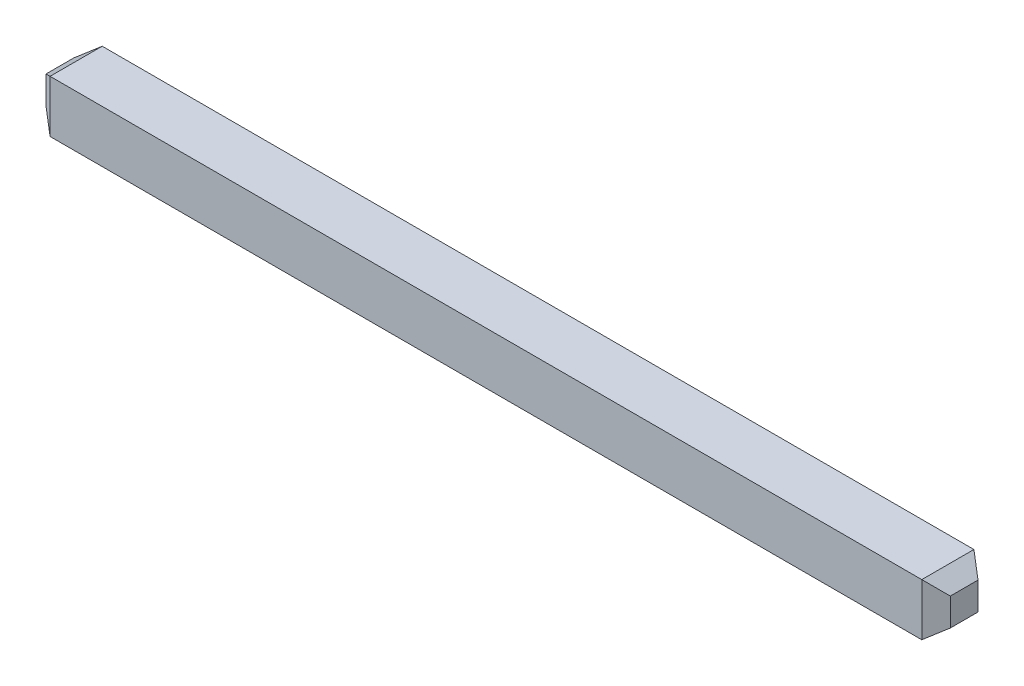
ISO-10303-21;
HEADER;
FILE_DESCRIPTION(('STEP AP214'),'2;1');
FILE_NAME('part.step','',(''),(''),'','','');
FILE_SCHEMA(('AUTOMOTIVE_DESIGN { 1 0 10303 214 1 1 1 1 }'));
ENDSEC;
DATA;
#1=APPLICATION_CONTEXT('core data for automotive mechanical design processes');
#2=APPLICATION_PROTOCOL_DEFINITION('international standard','automotive_design',2000,#1);
#3=PRODUCT_CONTEXT('',#1,'mechanical');
#4=PRODUCT('Part','Part','',(#3));
#5=PRODUCT_RELATED_PRODUCT_CATEGORY('part','',(#4));
#6=PRODUCT_DEFINITION_FORMATION('','',#4);
#7=PRODUCT_DEFINITION_CONTEXT('part definition',#1,'design');
#8=PRODUCT_DEFINITION('design','',#6,#7);
#9=PRODUCT_DEFINITION_SHAPE('','',#8);
#10=(LENGTH_UNIT() NAMED_UNIT(*) SI_UNIT(.MILLI.,.METRE.));
#11=(NAMED_UNIT(*) PLANE_ANGLE_UNIT() SI_UNIT($,.RADIAN.));
#12=(NAMED_UNIT(*) SI_UNIT($,.STERADIAN.) SOLID_ANGLE_UNIT());
#13=UNCERTAINTY_MEASURE_WITH_UNIT(LENGTH_MEASURE(1.E-05),#10,'distance_accuracy_value','');
#14=(GEOMETRIC_REPRESENTATION_CONTEXT(3) GLOBAL_UNCERTAINTY_ASSIGNED_CONTEXT((#13)) GLOBAL_UNIT_ASSIGNED_CONTEXT((#10,
#11,#12)) REPRESENTATION_CONTEXT('',''));
#15=CARTESIAN_POINT('',(0.,0.,0.));
#16=DIRECTION('',(0.,0.,1.));
#17=DIRECTION('',(1.,0.,0.));
#18=AXIS2_PLACEMENT_3D('',#15,#16,#17);
#19=CARTESIAN_POINT('',(-2.4,1.23,-19.295));
#20=DIRECTION('',(0.5999999999908,0.,0.8000000000069));
#21=DIRECTION('',(0.8000000000069,0.,-0.5999999999908));
#22=AXIS2_PLACEMENT_3D('',#19,#20,#21);
#23=PLANE('',#22);
#24=DIRECTION('',(0.,1.,0.));
#25=VECTOR('',#24,1.);
#26=CARTESIAN_POINT('',(-2.3,1.23,-19.37));
#27=LINE('',#26,#25);
#28=CARTESIAN_POINT('',(-2.29999999999957,1.55,-19.3699999999994));
#29=VERTEX_POINT('',#28);
#30=CARTESIAN_POINT('',(-2.29999999999958,0.909999999999898,-19.3699999999994));
#31=VERTEX_POINT('',#30);
#32=EDGE_CURVE('E101',#29,#31,#27,.F.);
#33=ORIENTED_EDGE('',*,*,#32,.T.);
#34=DIRECTION('',(-0.685994340569491,0.51449575542834,0.514495755427438));
#35=VECTOR('',#34,1.);
#36=CARTESIAN_POINT('',(-2.30000000000009,0.909999999999786,-19.37));
#37=LINE('',#36,#35);
#38=CARTESIAN_POINT('',(-2.50000000000021,1.06000000000001,-19.2200000000003));
#39=VERTEX_POINT('',#38);
#40=EDGE_CURVE('E85',#31,#39,#37,.T.);
#41=ORIENTED_EDGE('',*,*,#40,.T.);
#42=DIRECTION('',(0.,1.,0.));
#43=VECTOR('',#42,1.);
#44=CARTESIAN_POINT('',(-2.5,1.23,-19.22));
#45=LINE('',#44,#43);
#46=CARTESIAN_POINT('',(-2.50000000000043,1.4,-19.2200000000006));
#47=VERTEX_POINT('',#46);
#48=EDGE_CURVE('E79',#39,#47,#45,.T.);
#49=ORIENTED_EDGE('',*,*,#48,.T.);
#50=DIRECTION('',(-0.685994340570034,-0.514495755427526,0.514495755427528));
#51=VECTOR('',#50,1.);
#52=CARTESIAN_POINT('',(-2.3,1.55,-19.37));
#53=LINE('',#52,#51);
#54=EDGE_CURVE('E20',#29,#47,#53,.T.);
#55=ORIENTED_EDGE('',*,*,#54,.F.);
#56=EDGE_LOOP('',(#33,#41,#49,#55));
#57=FACE_BOUND('',#56,.T.);
#58=ADVANCED_FACE('F17',(#57),#23,.F.);
#59=CARTESIAN_POINT('',(8.5,1.23,-19.295));
#60=DIRECTION('',(-0.5999999999908,0.,0.8000000000069));
#61=DIRECTION('',(0.8000000000069,0.,0.5999999999908));
#62=AXIS2_PLACEMENT_3D('',#59,#60,#61);
#63=PLANE('',#62);
#64=DIRECTION('',(0.,1.,0.));
#65=VECTOR('',#64,1.);
#66=CARTESIAN_POINT('',(8.6,1.23,-19.22));
#67=LINE('',#66,#65);
#68=CARTESIAN_POINT('',(8.6000000000002,1.06000000000003,-19.2200000000003));
#69=VERTEX_POINT('',#68);
#70=CARTESIAN_POINT('',(8.60000000000043,1.4,-19.2200000000006));
#71=VERTEX_POINT('',#70);
#72=EDGE_CURVE('E113',#69,#71,#67,.T.);
#73=ORIENTED_EDGE('',*,*,#72,.F.);
#74=DIRECTION('',(-0.685994340569492,-0.51449575542834,-0.514495755427437));
#75=VECTOR('',#74,1.);
#76=CARTESIAN_POINT('',(8.59999999999996,1.06000000000005,-19.22));
#77=LINE('',#76,#75);
#78=CARTESIAN_POINT('',(8.39999999999959,0.909999999999884,-19.3699999999994));
#79=VERTEX_POINT('',#78);
#80=EDGE_CURVE('E108',#69,#79,#77,.T.);
#81=ORIENTED_EDGE('',*,*,#80,.T.);
#82=DIRECTION('',(0.,1.,0.));
#83=VECTOR('',#82,1.);
#84=CARTESIAN_POINT('',(8.4,1.23,-19.37));
#85=LINE('',#84,#83);
#86=CARTESIAN_POINT('',(8.39999999999957,1.55,-19.3699999999994));
#87=VERTEX_POINT('',#86);
#88=EDGE_CURVE('E99',#79,#87,#85,.T.);
#89=ORIENTED_EDGE('',*,*,#88,.T.);
#90=DIRECTION('',(-0.685994340570033,0.514495755427525,-0.514495755427531));
#91=VECTOR('',#90,1.);
#92=CARTESIAN_POINT('',(8.6,1.4,-19.22));
#93=LINE('',#92,#91);
#94=EDGE_CURVE('E116',#71,#87,#93,.T.);
#95=ORIENTED_EDGE('',*,*,#94,.F.);
#96=EDGE_LOOP('',(#73,#81,#89,#95));
#97=FACE_BOUND('',#96,.T.);
#98=ADVANCED_FACE('F214',(#97),#63,.F.);
#99=CARTESIAN_POINT('',(-2.4,1.475,-19.05));
#100=DIRECTION('',(-0.6,0.8,0.));
#101=DIRECTION('',(-0.8,-0.6,0.));
#102=AXIS2_PLACEMENT_3D('',#99,#100,#101);
#103=PLANE('',#102);
#104=DIRECTION('',(-0.685994340575993,-0.514495755427528,-0.514495755419581));
#105=VECTOR('',#104,1.);
#106=CARTESIAN_POINT('',(-2.29999999999913,1.55,-18.7300000000012));
#107=LINE('',#106,#105);
#108=CARTESIAN_POINT('',(-2.29999999999989,1.55,-18.7300000000001));
#109=VERTEX_POINT('',#108);
#110=CARTESIAN_POINT('',(-2.50000000000022,1.4,-18.8799999999997));
#111=VERTEX_POINT('',#110);
#112=EDGE_CURVE('E128',#109,#111,#107,.T.);
#113=ORIENTED_EDGE('',*,*,#112,.F.);
#114=DIRECTION('',(0.,0.,1.));
#115=VECTOR('',#114,1.);
#116=CARTESIAN_POINT('',(-2.3,1.55,-19.05));
#117=LINE('',#116,#115);
#118=EDGE_CURVE('E93',#29,#109,#117,.T.);
#119=ORIENTED_EDGE('',*,*,#118,.F.);
#120=ORIENTED_EDGE('',*,*,#54,.T.);
#121=DIRECTION('',(0.,0.,-1.));
#122=VECTOR('',#121,1.);
#123=CARTESIAN_POINT('',(-2.5,1.4,-19.05));
#124=LINE('',#123,#122);
#125=EDGE_CURVE('E87',#47,#111,#124,.F.);
#126=ORIENTED_EDGE('',*,*,#125,.T.);
#127=EDGE_LOOP('',(#113,#119,#120,#126));
#128=FACE_BOUND('',#127,.T.);
#129=ADVANCED_FACE('F90',(#128),#103,.T.);
#130=CARTESIAN_POINT('',(-2.5,1.23,-19.05));
#131=DIRECTION('',(1.,0.,0.));
#132=DIRECTION('',(0.,0.,-1.));
#133=AXIS2_PLACEMENT_3D('',#130,#131,#132);
#134=PLANE('',#133);
#135=DIRECTION('',(0.,1.,0.));
#136=VECTOR('',#135,1.);
#137=CARTESIAN_POINT('',(-2.50000000000087,1.23,-18.8799999999988));
#138=LINE('',#137,#136);
#139=CARTESIAN_POINT('',(-2.50000000000021,1.06000000000001,-18.8799999999997));
#140=VERTEX_POINT('',#139);
#141=EDGE_CURVE('E97',#111,#140,#138,.F.);
#142=ORIENTED_EDGE('',*,*,#141,.F.);
#143=ORIENTED_EDGE('',*,*,#125,.F.);
#144=ORIENTED_EDGE('',*,*,#48,.F.);
#145=DIRECTION('',(0.,0.,1.));
#146=VECTOR('',#145,1.);
#147=CARTESIAN_POINT('',(-2.49999999999996,1.06000000000005,-19.05));
#148=LINE('',#147,#146);
#149=EDGE_CURVE('E105',#39,#140,#148,.T.);
#150=ORIENTED_EDGE('',*,*,#149,.T.);
#151=EDGE_LOOP('',(#142,#143,#144,#150));
#152=FACE_BOUND('',#151,.T.);
#153=ADVANCED_FACE('F95',(#152),#134,.F.);
#154=CARTESIAN_POINT('',(3.05,1.23,-19.37));
#155=DIRECTION('',(0.,0.,1.));
#156=DIRECTION('',(1.,0.,0.));
#157=AXIS2_PLACEMENT_3D('',#154,#155,#156);
#158=PLANE('',#157);
#159=ORIENTED_EDGE('',*,*,#32,.F.);
#160=DIRECTION('',(1.,0.,0.));
#161=VECTOR('',#160,1.);
#162=CARTESIAN_POINT('',(3.05,1.55,-19.37));
#163=LINE('',#162,#161);
#164=EDGE_CURVE('E122',#87,#29,#163,.F.);
#165=ORIENTED_EDGE('',*,*,#164,.F.);
#166=ORIENTED_EDGE('',*,*,#88,.F.);
#167=DIRECTION('',(1.,0.,0.));
#168=VECTOR('',#167,1.);
#169=CARTESIAN_POINT('',(3.05,0.91,-19.37));
#170=LINE('',#169,#168);
#171=EDGE_CURVE('E136',#79,#31,#170,.F.);
#172=ORIENTED_EDGE('',*,*,#171,.T.);
#173=EDGE_LOOP('',(#159,#165,#166,#172));
#174=FACE_BOUND('',#173,.T.);
#175=ADVANCED_FACE('F182',(#174),#158,.F.);
#176=CARTESIAN_POINT('',(-2.4,0.9849999999999,-19.05));
#177=DIRECTION('',(0.600000000000912,0.799999999999316,0.));
#178=DIRECTION('',(-0.799999999999316,0.600000000000912,0.));
#179=AXIS2_PLACEMENT_3D('',#176,#177,#178);
#180=PLANE('',#179);
#181=DIRECTION('',(0.,0.,1.));
#182=VECTOR('',#181,1.);
#183=CARTESIAN_POINT('',(-2.3,0.91,-19.05));
#184=LINE('',#183,#182);
#185=CARTESIAN_POINT('',(-2.29999999999983,0.909999999999856,-18.7300000000003));
#186=VERTEX_POINT('',#185);
#187=EDGE_CURVE('E139',#31,#186,#184,.T.);
#188=ORIENTED_EDGE('',*,*,#187,.T.);
#189=DIRECTION('',(0.685994340575872,-0.514495755427781,0.51449575541949));
#190=VECTOR('',#189,1.);
#191=CARTESIAN_POINT('',(-2.50000000000087,1.06,-18.8799999999988));
#192=LINE('',#191,#190);
#193=EDGE_CURVE('E131',#140,#186,#192,.T.);
#194=ORIENTED_EDGE('',*,*,#193,.F.);
#195=ORIENTED_EDGE('',*,*,#149,.F.);
#196=ORIENTED_EDGE('',*,*,#40,.F.);
#197=EDGE_LOOP('',(#188,#194,#195,#196));
#198=FACE_BOUND('',#197,.T.);
#199=ADVANCED_FACE('F179',(#198),#180,.F.);
#200=CARTESIAN_POINT('',(8.5,0.9849999999999,-19.05));
#201=DIRECTION('',(-0.600000000000912,0.799999999999316,0.));
#202=DIRECTION('',(-0.799999999999316,-0.600000000000912,0.));
#203=AXIS2_PLACEMENT_3D('',#200,#201,#202);
#204=PLANE('',#203);
#205=DIRECTION('',(0.,0.,-1.));
#206=VECTOR('',#205,1.);
#207=CARTESIAN_POINT('',(8.6,1.06,-19.05));
#208=LINE('',#207,#206);
#209=CARTESIAN_POINT('',(8.6000000000002,1.06000000000003,-18.8799999999997));
#210=VERTEX_POINT('',#209);
#211=EDGE_CURVE('E110',#210,#69,#208,.T.);
#212=ORIENTED_EDGE('',*,*,#211,.F.);
#213=DIRECTION('',(0.68599434057587,0.514495755427782,-0.514495755419492));
#214=VECTOR('',#213,1.);
#215=CARTESIAN_POINT('',(8.39999999999913,0.9099999999999,-18.7300000000012));
#216=LINE('',#215,#214);
#217=CARTESIAN_POINT('',(8.39999999999993,0.909999999999868,-18.7300000000001));
#218=VERTEX_POINT('',#217);
#219=EDGE_CURVE('E35',#218,#210,#216,.T.);
#220=ORIENTED_EDGE('',*,*,#219,.F.);
#221=DIRECTION('',(0.,0.,1.));
#222=VECTOR('',#221,1.);
#223=CARTESIAN_POINT('',(8.4,0.91,-19.05));
#224=LINE('',#223,#222);
#225=EDGE_CURVE('E134',#218,#79,#224,.F.);
#226=ORIENTED_EDGE('',*,*,#225,.T.);
#227=ORIENTED_EDGE('',*,*,#80,.F.);
#228=EDGE_LOOP('',(#212,#220,#226,#227));
#229=FACE_BOUND('',#228,.T.);
#230=ADVANCED_FACE('F181',(#229),#204,.F.);
#231=CARTESIAN_POINT('',(8.6,1.23,-19.05));
#232=DIRECTION('',(1.,0.,0.));
#233=DIRECTION('',(0.,0.,-1.));
#234=AXIS2_PLACEMENT_3D('',#231,#232,#233);
#235=PLANE('',#234);
#236=ORIENTED_EDGE('',*,*,#72,.T.);
#237=DIRECTION('',(0.,0.,1.));
#238=VECTOR('',#237,1.);
#239=CARTESIAN_POINT('',(8.6,1.4,-19.05));
#240=LINE('',#239,#238);
#241=CARTESIAN_POINT('',(8.60000000000022,1.4,-18.8799999999997));
#242=VERTEX_POINT('',#241);
#243=EDGE_CURVE('E119',#242,#71,#240,.F.);
#244=ORIENTED_EDGE('',*,*,#243,.F.);
#245=DIRECTION('',(0.,1.,0.));
#246=VECTOR('',#245,1.);
#247=CARTESIAN_POINT('',(8.60000000000087,1.23,-18.8799999999988));
#248=LINE('',#247,#246);
#249=EDGE_CURVE('E142',#210,#242,#248,.T.);
#250=ORIENTED_EDGE('',*,*,#249,.F.);
#251=ORIENTED_EDGE('',*,*,#211,.T.);
#252=EDGE_LOOP('',(#236,#244,#250,#251));
#253=FACE_BOUND('',#252,.T.);
#254=ADVANCED_FACE('F189',(#253),#235,.T.);
#255=CARTESIAN_POINT('',(8.5,1.475,-19.05));
#256=DIRECTION('',(0.6,0.8,0.));
#257=DIRECTION('',(-0.8,0.6,0.));
#258=AXIS2_PLACEMENT_3D('',#255,#256,#257);
#259=PLANE('',#258);
#260=DIRECTION('',(-0.685994340575991,0.51449575542753,0.514495755419583));
#261=VECTOR('',#260,1.);
#262=CARTESIAN_POINT('',(8.60000000000087,1.4,-18.8799999999988));
#263=LINE('',#262,#261);
#264=CARTESIAN_POINT('',(8.39999999999989,1.55,-18.7300000000001));
#265=VERTEX_POINT('',#264);
#266=EDGE_CURVE('E145',#242,#265,#263,.T.);
#267=ORIENTED_EDGE('',*,*,#266,.F.);
#268=ORIENTED_EDGE('',*,*,#243,.T.);
#269=ORIENTED_EDGE('',*,*,#94,.T.);
#270=DIRECTION('',(0.,0.,1.));
#271=VECTOR('',#270,1.);
#272=CARTESIAN_POINT('',(8.4,1.55,-19.05));
#273=LINE('',#272,#271);
#274=EDGE_CURVE('E125',#265,#87,#273,.F.);
#275=ORIENTED_EDGE('',*,*,#274,.F.);
#276=EDGE_LOOP('',(#267,#268,#269,#275));
#277=FACE_BOUND('',#276,.T.);
#278=ADVANCED_FACE('F170',(#277),#259,.T.);
#279=CARTESIAN_POINT('',(3.05,1.55,-19.05));
#280=DIRECTION('',(0.,1.,0.));
#281=DIRECTION('',(0.,0.,1.));
#282=AXIS2_PLACEMENT_3D('',#279,#280,#281);
#283=PLANE('',#282);
#284=DIRECTION('',(1.,0.,0.));
#285=VECTOR('',#284,1.);
#286=CARTESIAN_POINT('',(3.05,1.55,-18.73));
#287=LINE('',#286,#285);
#288=EDGE_CURVE('E148',#265,#109,#287,.F.);
#289=ORIENTED_EDGE('',*,*,#288,.F.);
#290=ORIENTED_EDGE('',*,*,#274,.T.);
#291=ORIENTED_EDGE('',*,*,#164,.T.);
#292=ORIENTED_EDGE('',*,*,#118,.T.);
#293=EDGE_LOOP('',(#289,#290,#291,#292));
#294=FACE_BOUND('',#293,.T.);
#295=ADVANCED_FACE('F173',(#294),#283,.T.);
#296=CARTESIAN_POINT('',(-2.4,1.23,-18.805));
#297=DIRECTION('',(-0.599999999990736,0.,0.800000000006948));
#298=DIRECTION('',(0.800000000006948,0.,0.599999999990736));
#299=AXIS2_PLACEMENT_3D('',#296,#297,#298);
#300=PLANE('',#299);
#301=ORIENTED_EDGE('',*,*,#193,.T.);
#302=DIRECTION('',(0.,1.,0.));
#303=VECTOR('',#302,1.);
#304=CARTESIAN_POINT('',(-2.3,1.23,-18.73));
#305=LINE('',#304,#303);
#306=EDGE_CURVE('E151',#109,#186,#305,.F.);
#307=ORIENTED_EDGE('',*,*,#306,.F.);
#308=ORIENTED_EDGE('',*,*,#112,.T.);
#309=ORIENTED_EDGE('',*,*,#141,.T.);
#310=EDGE_LOOP('',(#301,#307,#308,#309));
#311=FACE_BOUND('',#310,.T.);
#312=ADVANCED_FACE('F176',(#311),#300,.T.);
#313=CARTESIAN_POINT('',(3.05,0.91,-19.05));
#314=DIRECTION('',(0.,1.,0.));
#315=DIRECTION('',(0.,0.,1.));
#316=AXIS2_PLACEMENT_3D('',#313,#314,#315);
#317=PLANE('',#316);
#318=ORIENTED_EDGE('',*,*,#187,.F.);
#319=ORIENTED_EDGE('',*,*,#171,.F.);
#320=ORIENTED_EDGE('',*,*,#225,.F.);
#321=DIRECTION('',(1.,0.,0.));
#322=VECTOR('',#321,1.);
#323=CARTESIAN_POINT('',(3.05,0.9099999999999,-18.73));
#324=LINE('',#323,#322);
#325=EDGE_CURVE('E26',#186,#218,#324,.T.);
#326=ORIENTED_EDGE('',*,*,#325,.F.);
#327=EDGE_LOOP('',(#318,#319,#320,#326));
#328=FACE_BOUND('',#327,.T.);
#329=ADVANCED_FACE('F162',(#328),#317,.F.);
#330=CARTESIAN_POINT('',(8.5,1.23,-18.805));
#331=DIRECTION('',(0.599999999990736,0.,0.800000000006948));
#332=DIRECTION('',(0.800000000006948,0.,-0.599999999990736));
#333=AXIS2_PLACEMENT_3D('',#330,#331,#332);
#334=PLANE('',#333);
#335=ORIENTED_EDGE('',*,*,#266,.T.);
#336=DIRECTION('',(0.,1.,0.));
#337=VECTOR('',#336,1.);
#338=CARTESIAN_POINT('',(8.4,1.23,-18.73));
#339=LINE('',#338,#337);
#340=EDGE_CURVE('E11',#218,#265,#339,.T.);
#341=ORIENTED_EDGE('',*,*,#340,.F.);
#342=ORIENTED_EDGE('',*,*,#219,.T.);
#343=ORIENTED_EDGE('',*,*,#249,.T.);
#344=EDGE_LOOP('',(#335,#341,#342,#343));
#345=FACE_BOUND('',#344,.T.);
#346=ADVANCED_FACE('F166',(#345),#334,.T.);
#347=CARTESIAN_POINT('',(3.05,1.23,-18.73));
#348=DIRECTION('',(0.,0.,1.));
#349=DIRECTION('',(1.,0.,0.));
#350=AXIS2_PLACEMENT_3D('',#347,#348,#349);
#351=PLANE('',#350);
#352=ORIENTED_EDGE('',*,*,#325,.T.);
#353=ORIENTED_EDGE('',*,*,#340,.T.);
#354=ORIENTED_EDGE('',*,*,#288,.T.);
#355=ORIENTED_EDGE('',*,*,#306,.T.);
#356=EDGE_LOOP('',(#352,#353,#354,#355));
#357=FACE_BOUND('',#356,.T.);
#358=ADVANCED_FACE('F157',(#357),#351,.T.);
#359=CLOSED_SHELL('',(#58,#98,#129,#153,#175,#199,#230,#254,#278,#295,#312,#329,#346,#358));
#360=MANIFOLD_SOLID_BREP('B1',#359);
#361=ADVANCED_BREP_SHAPE_REPRESENTATION('',(#18,#360),#14);
#362=SHAPE_DEFINITION_REPRESENTATION(#9,#361);
ENDSEC;
END-ISO-10303-21;
